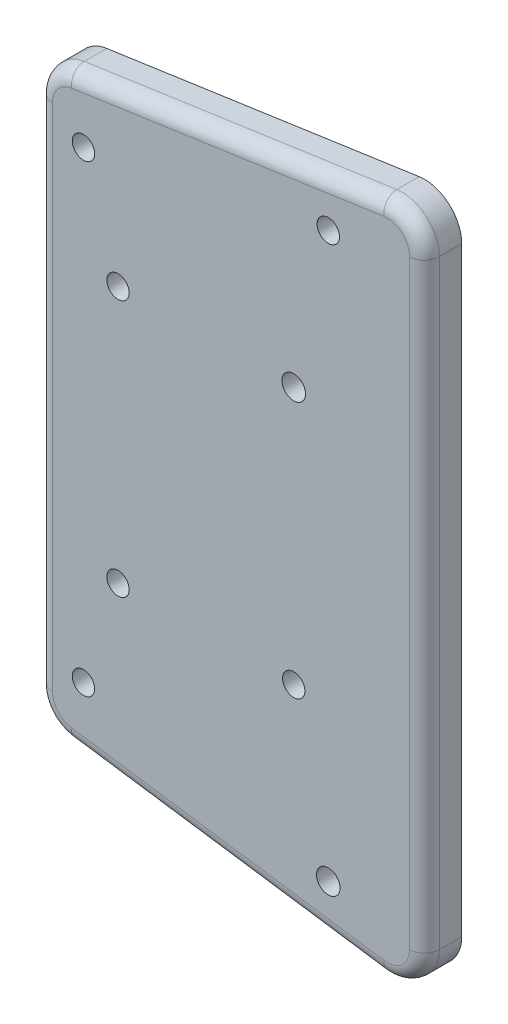
ISO-10303-21;
HEADER;
FILE_DESCRIPTION(('STEP AP214'),'2;1');
FILE_NAME('part.step','',(''),(''),'','','');
FILE_SCHEMA(('AUTOMOTIVE_DESIGN { 1 0 10303 214 1 1 1 1 }'));
ENDSEC;
DATA;
#1=APPLICATION_CONTEXT('core data for automotive mechanical design processes');
#2=APPLICATION_PROTOCOL_DEFINITION('international standard','automotive_design',2000,#1);
#3=PRODUCT_CONTEXT('',#1,'mechanical');
#4=PRODUCT('Part','Part','',(#3));
#5=PRODUCT_RELATED_PRODUCT_CATEGORY('part','',(#4));
#6=PRODUCT_DEFINITION_FORMATION('','',#4);
#7=PRODUCT_DEFINITION_CONTEXT('part definition',#1,'design');
#8=PRODUCT_DEFINITION('design','',#6,#7);
#9=PRODUCT_DEFINITION_SHAPE('','',#8);
#10=(LENGTH_UNIT() NAMED_UNIT(*) SI_UNIT(.MILLI.,.METRE.));
#11=(NAMED_UNIT(*) PLANE_ANGLE_UNIT() SI_UNIT($,.RADIAN.));
#12=(NAMED_UNIT(*) SI_UNIT($,.STERADIAN.) SOLID_ANGLE_UNIT());
#13=UNCERTAINTY_MEASURE_WITH_UNIT(LENGTH_MEASURE(1.E-05),#10,'distance_accuracy_value','');
#14=(GEOMETRIC_REPRESENTATION_CONTEXT(3) GLOBAL_UNCERTAINTY_ASSIGNED_CONTEXT((#13)) GLOBAL_UNIT_ASSIGNED_CONTEXT((#10,
#11,#12)) REPRESENTATION_CONTEXT('',''));
#15=CARTESIAN_POINT('',(0.,0.,0.));
#16=DIRECTION('',(0.,0.,1.));
#17=DIRECTION('',(1.,0.,0.));
#18=AXIS2_PLACEMENT_3D('',#15,#16,#17);
#19=CARTESIAN_POINT('',(20.9522005106054,40.2414995289311,5.));
#20=DIRECTION('',(0.,0.,-1.));
#21=DIRECTION('',(-1.,0.,0.));
#22=AXIS2_PLACEMENT_3D('',#19,#20,#21);
#23=PLANE('',#22);
#24=CARTESIAN_POINT('',(20.9522005106054,40.2414995289311,5.));
#25=DIRECTION('',(0.,0.,-1.));
#26=DIRECTION('',(-1.,0.,0.));
#27=AXIS2_PLACEMENT_3D('',#24,#25,#26);
#28=CIRCLE('',#27,3.);
#29=CARTESIAN_POINT('',(23.9522005106054,40.2414995289311,5.));
#30=VERTEX_POINT('',#29);
#31=CARTESIAN_POINT('',(20.5228210609367,43.210612744725,5.));
#32=VERTEX_POINT('',#31);
#33=EDGE_CURVE('E226',#30,#32,#28,.F.);
#34=ORIENTED_EDGE('',*,*,#33,.T.);
#35=DIRECTION('',(-0.989704405264646,-0.143126483222894,0.));
#36=VECTOR('',#35,1.);
#37=CARTESIAN_POINT('',(20.5228210609367,43.210612744725,5.));
#38=LINE('',#37,#36);
#39=CARTESIAN_POINT('',(-21.3815799602741,37.150591673965,5.));
#40=VERTEX_POINT('',#39);
#41=EDGE_CURVE('E229',#32,#40,#38,.T.);
#42=ORIENTED_EDGE('',*,*,#41,.T.);
#43=CARTESIAN_POINT('',(-20.9522005106054,34.1814784581711,5.));
#44=DIRECTION('',(0.,0.,-1.));
#45=DIRECTION('',(-1.,0.,0.));
#46=AXIS2_PLACEMENT_3D('',#43,#44,#45);
#47=CIRCLE('',#46,3.);
#48=CARTESIAN_POINT('',(-23.9522005106054,34.181478458171,5.));
#49=VERTEX_POINT('',#48);
#50=EDGE_CURVE('E142',#40,#49,#47,.F.);
#51=ORIENTED_EDGE('',*,*,#50,.T.);
#52=DIRECTION('',(0.,-1.,0.));
#53=VECTOR('',#52,1.);
#54=CARTESIAN_POINT('',(-23.9522005106054,40.2414995289311,5.));
#55=LINE('',#54,#53);
#56=CARTESIAN_POINT('',(-23.9522005106054,-34.181478458171,5.));
#57=VERTEX_POINT('',#56);
#58=EDGE_CURVE('E211',#49,#57,#55,.T.);
#59=ORIENTED_EDGE('',*,*,#58,.T.);
#60=CARTESIAN_POINT('',(-20.9522005106054,-34.1814784581711,5.));
#61=DIRECTION('',(0.,0.,-1.));
#62=DIRECTION('',(-1.,0.,0.));
#63=AXIS2_PLACEMENT_3D('',#60,#61,#62);
#64=CIRCLE('',#63,3.);
#65=CARTESIAN_POINT('',(-21.3815799602741,-37.150591673965,5.));
#66=VERTEX_POINT('',#65);
#67=EDGE_CURVE('E214',#57,#66,#64,.F.);
#68=ORIENTED_EDGE('',*,*,#67,.T.);
#69=DIRECTION('',(0.989704405264646,-0.143126483222894,0.));
#70=VECTOR('',#69,1.);
#71=CARTESIAN_POINT('',(9.12216996194288,-41.5619032011782,5.));
#72=LINE('',#71,#70);
#73=CARTESIAN_POINT('',(20.5228210609367,-43.210612744725,5.));
#74=VERTEX_POINT('',#73);
#75=EDGE_CURVE('E217',#66,#74,#72,.T.);
#76=ORIENTED_EDGE('',*,*,#75,.T.);
#77=CARTESIAN_POINT('',(20.9522005106054,-40.2414995289311,5.));
#78=DIRECTION('',(0.,0.,-1.));
#79=DIRECTION('',(-1.,0.,0.));
#80=AXIS2_PLACEMENT_3D('',#77,#78,#79);
#81=CIRCLE('',#80,3.);
#82=CARTESIAN_POINT('',(23.9522005106054,-40.2414995289311,5.));
#83=VERTEX_POINT('',#82);
#84=EDGE_CURVE('E220',#74,#83,#81,.F.);
#85=ORIENTED_EDGE('',*,*,#84,.T.);
#86=DIRECTION('',(0.,1.,0.));
#87=VECTOR('',#86,1.);
#88=CARTESIAN_POINT('',(23.9522005106054,40.2414995289311,5.));
#89=LINE('',#88,#87);
#90=EDGE_CURVE('E223',#83,#30,#89,.T.);
#91=ORIENTED_EDGE('',*,*,#90,.T.);
#92=EDGE_LOOP('',(#34,#42,#51,#59,#68,#76,#85,#91));
#93=FACE_BOUND('',#92,.T.);
#94=CARTESIAN_POINT('',(13.0543618225583,-37.7671205202591,5.));
#95=DIRECTION('',(0.,0.,1.));
#96=DIRECTION('',(1.,0.,0.));
#97=AXIS2_PLACEMENT_3D('',#94,#95,#96);
#98=CIRCLE('',#97,1.57879856612062);
#99=CARTESIAN_POINT('',(14.6331603886789,-37.7671205202591,5.));
#100=VERTEX_POINT('',#99);
#101=EDGE_CURVE('E161',#100,#100,#98,.T.);
#102=ORIENTED_EDGE('',*,*,#101,.F.);
#103=EDGE_LOOP('',(#102));
#104=FACE_BOUND('',#103,.T.);
#105=CARTESIAN_POINT('',(-19.7867074188694,-31.0798565818886,5.));
#106=DIRECTION('',(0.,0.,1.));
#107=DIRECTION('',(1.,0.,0.));
#108=AXIS2_PLACEMENT_3D('',#105,#106,#107);
#109=CIRCLE('',#108,1.5);
#110=CARTESIAN_POINT('',(-18.2867074188694,-31.0798565818886,5.));
#111=VERTEX_POINT('',#110);
#112=EDGE_CURVE('E336',#111,#111,#109,.T.);
#113=ORIENTED_EDGE('',*,*,#112,.F.);
#114=EDGE_LOOP('',(#113));
#115=FACE_BOUND('',#114,.T.);
#116=CARTESIAN_POINT('',(8.41783083386927,-17.2314439170671,5.));
#117=DIRECTION('',(0.,0.,1.));
#118=DIRECTION('',(1.,0.,0.));
#119=AXIS2_PLACEMENT_3D('',#116,#117,#118);
#120=CIRCLE('',#119,1.5);
#121=CARTESIAN_POINT('',(9.91783083386926,-17.2314439170671,5.));
#122=VERTEX_POINT('',#121);
#123=EDGE_CURVE('E328',#122,#122,#120,.T.);
#124=ORIENTED_EDGE('',*,*,#123,.F.);
#125=EDGE_LOOP('',(#124));
#126=FACE_BOUND('',#125,.T.);
#127=CARTESIAN_POINT('',(-15.1501764301804,-17.2314439170671,5.));
#128=DIRECTION('',(0.,0.,1.));
#129=DIRECTION('',(1.,0.,0.));
#130=AXIS2_PLACEMENT_3D('',#127,#128,#129);
#131=CIRCLE('',#130,1.5);
#132=CARTESIAN_POINT('',(-13.6501764301804,-17.2314439170671,5.));
#133=VERTEX_POINT('',#132);
#134=EDGE_CURVE('E320',#133,#133,#131,.T.);
#135=ORIENTED_EDGE('',*,*,#134,.F.);
#136=EDGE_LOOP('',(#135));
#137=FACE_BOUND('',#136,.T.);
#138=CARTESIAN_POINT('',(8.41783083386927,17.3135515468837,5.));
#139=DIRECTION('',(0.,0.,1.));
#140=DIRECTION('',(1.,0.,0.));
#141=AXIS2_PLACEMENT_3D('',#138,#139,#140);
#142=CIRCLE('',#141,1.58210762981665);
#143=CARTESIAN_POINT('',(9.99993846368592,17.3135515468837,5.));
#144=VERTEX_POINT('',#143);
#145=EDGE_CURVE('E312',#144,#144,#142,.T.);
#146=ORIENTED_EDGE('',*,*,#145,.F.);
#147=EDGE_LOOP('',(#146));
#148=FACE_BOUND('',#147,.T.);
#149=CARTESIAN_POINT('',(-15.1501764301804,17.2314439170671,5.));
#150=DIRECTION('',(0.,0.,1.));
#151=DIRECTION('',(1.,0.,0.));
#152=AXIS2_PLACEMENT_3D('',#149,#150,#151);
#153=CIRCLE('',#152,1.5);
#154=CARTESIAN_POINT('',(-13.6501764301804,17.2314439170671,5.));
#155=VERTEX_POINT('',#154);
#156=EDGE_CURVE('E304',#155,#155,#153,.T.);
#157=ORIENTED_EDGE('',*,*,#156,.F.);
#158=EDGE_LOOP('',(#157));
#159=FACE_BOUND('',#158,.T.);
#160=CARTESIAN_POINT('',(-19.7867074188694,31.0798565818886,5.));
#161=DIRECTION('',(0.,0.,1.));
#162=DIRECTION('',(1.,0.,0.));
#163=AXIS2_PLACEMENT_3D('',#160,#161,#162);
#164=CIRCLE('',#163,1.5);
#165=CARTESIAN_POINT('',(-18.2867074188694,31.0798565818886,5.));
#166=VERTEX_POINT('',#165);
#167=EDGE_CURVE('E296',#166,#166,#164,.T.);
#168=ORIENTED_EDGE('',*,*,#167,.F.);
#169=EDGE_LOOP('',(#168));
#170=FACE_BOUND('',#169,.T.);
#171=CARTESIAN_POINT('',(13.0543618225583,37.8459190863797,5.));
#172=DIRECTION('',(0.,0.,1.));
#173=DIRECTION('',(1.,0.,0.));
#174=AXIS2_PLACEMENT_3D('',#171,#172,#173);
#175=CIRCLE('',#174,1.5);
#176=CARTESIAN_POINT('',(14.5543618225583,37.8459190863797,5.));
#177=VERTEX_POINT('',#176);
#178=EDGE_CURVE('E287',#177,#177,#175,.T.);
#179=ORIENTED_EDGE('',*,*,#178,.F.);
#180=EDGE_LOOP('',(#179));
#181=FACE_BOUND('',#180,.T.);
#182=ADVANCED_FACE('F39',(#93,#104,#115,#126,#137,#148,#159,#170,#181),#23,.F.);
#183=CARTESIAN_POINT('',(20.9522005106054,40.2414995289311,0.));
#184=DIRECTION('',(0.,0.,-1.));
#185=DIRECTION('',(-1.,0.,0.));
#186=AXIS2_PLACEMENT_3D('',#183,#184,#185);
#187=PLANE('',#186);
#188=CARTESIAN_POINT('',(-19.7867074188694,31.0798565818886,0.));
#189=DIRECTION('',(0.,0.,1.));
#190=DIRECTION('',(1.,0.,0.));
#191=AXIS2_PLACEMENT_3D('',#188,#189,#190);
#192=CIRCLE('',#191,1.5);
#193=CARTESIAN_POINT('',(-18.2867074188694,31.0798565818886,0.));
#194=VERTEX_POINT('',#193);
#195=EDGE_CURVE('E293',#194,#194,#192,.T.);
#196=ORIENTED_EDGE('',*,*,#195,.T.);
#197=EDGE_LOOP('',(#196));
#198=FACE_BOUND('',#197,.T.);
#199=CARTESIAN_POINT('',(8.41783083386927,17.3135515468837,0.));
#200=DIRECTION('',(0.,0.,1.));
#201=DIRECTION('',(1.,0.,0.));
#202=AXIS2_PLACEMENT_3D('',#199,#200,#201);
#203=CIRCLE('',#202,1.58210762981665);
#204=CARTESIAN_POINT('',(9.99993846368592,17.3135515468837,0.));
#205=VERTEX_POINT('',#204);
#206=EDGE_CURVE('E308',#205,#205,#203,.T.);
#207=ORIENTED_EDGE('',*,*,#206,.T.);
#208=EDGE_LOOP('',(#207));
#209=FACE_BOUND('',#208,.T.);
#210=CARTESIAN_POINT('',(8.41783083386927,-17.2314439170671,0.));
#211=DIRECTION('',(0.,0.,1.));
#212=DIRECTION('',(1.,0.,0.));
#213=AXIS2_PLACEMENT_3D('',#210,#211,#212);
#214=CIRCLE('',#213,1.5);
#215=CARTESIAN_POINT('',(9.91783083386926,-17.2314439170671,0.));
#216=VERTEX_POINT('',#215);
#217=EDGE_CURVE('E324',#216,#216,#214,.T.);
#218=ORIENTED_EDGE('',*,*,#217,.T.);
#219=EDGE_LOOP('',(#218));
#220=FACE_BOUND('',#219,.T.);
#221=CARTESIAN_POINT('',(13.0543618225583,-37.7671205202591,0.));
#222=DIRECTION('',(0.,0.,1.));
#223=DIRECTION('',(1.,0.,0.));
#224=AXIS2_PLACEMENT_3D('',#221,#222,#223);
#225=CIRCLE('',#224,1.57879856612062);
#226=CARTESIAN_POINT('',(14.6331603886789,-37.7671205202591,0.));
#227=VERTEX_POINT('',#226);
#228=EDGE_CURVE('E165',#227,#227,#225,.T.);
#229=ORIENTED_EDGE('',*,*,#228,.T.);
#230=EDGE_LOOP('',(#229));
#231=FACE_BOUND('',#230,.T.);
#232=CARTESIAN_POINT('',(20.9522005106054,40.2414995289311,0.));
#233=DIRECTION('',(0.,0.,1.));
#234=DIRECTION('',(-1.,0.,0.));
#235=AXIS2_PLACEMENT_3D('',#232,#233,#234);
#236=CIRCLE('',#235,5.);
#237=CARTESIAN_POINT('',(25.9522005106054,40.241499528931,0.));
#238=VERTEX_POINT('',#237);
#239=CARTESIAN_POINT('',(20.2365680944909,45.1900215552543,0.));
#240=VERTEX_POINT('',#239);
#241=EDGE_CURVE('E150',#238,#240,#236,.T.);
#242=ORIENTED_EDGE('',*,*,#241,.F.);
#243=DIRECTION('',(0.,1.,0.));
#244=VECTOR('',#243,1.);
#245=CARTESIAN_POINT('',(25.9522005106054,-40.241499528931,0.));
#246=LINE('',#245,#244);
#247=CARTESIAN_POINT('',(25.9522005106054,-40.2414995289311,0.));
#248=VERTEX_POINT('',#247);
#249=EDGE_CURVE('E187',#248,#238,#246,.T.);
#250=ORIENTED_EDGE('',*,*,#249,.F.);
#251=CARTESIAN_POINT('',(20.9522005106054,-40.2414995289311,0.));
#252=DIRECTION('',(0.,0.,1.));
#253=DIRECTION('',(1.,0.,0.));
#254=AXIS2_PLACEMENT_3D('',#251,#252,#253);
#255=CIRCLE('',#254,5.);
#256=CARTESIAN_POINT('',(20.2365680944909,-45.1900215552543,0.));
#257=VERTEX_POINT('',#256);
#258=EDGE_CURVE('E183',#257,#248,#255,.T.);
#259=ORIENTED_EDGE('',*,*,#258,.F.);
#260=DIRECTION('',(0.989704405264646,-0.143126483222894,0.));
#261=VECTOR('',#260,1.);
#262=CARTESIAN_POINT('',(20.2365680944909,-45.1900215552543,0.));
#263=LINE('',#262,#261);
#264=CARTESIAN_POINT('',(-21.6678329267199,-39.1300004844943,0.));
#265=VERTEX_POINT('',#264);
#266=EDGE_CURVE('E179',#265,#257,#263,.T.);
#267=ORIENTED_EDGE('',*,*,#266,.F.);
#268=CARTESIAN_POINT('',(-20.9522005106054,-34.1814784581711,0.));
#269=DIRECTION('',(0.,0.,1.));
#270=DIRECTION('',(-1.,0.,0.));
#271=AXIS2_PLACEMENT_3D('',#268,#269,#270);
#272=CIRCLE('',#271,5.);
#273=CARTESIAN_POINT('',(-25.9522005106054,-34.181478458171,0.));
#274=VERTEX_POINT('',#273);
#275=EDGE_CURVE('E175',#274,#265,#272,.T.);
#276=ORIENTED_EDGE('',*,*,#275,.F.);
#277=DIRECTION('',(0.,-1.,0.));
#278=VECTOR('',#277,1.);
#279=CARTESIAN_POINT('',(-25.9522005106054,-34.181478458171,0.));
#280=LINE('',#279,#278);
#281=CARTESIAN_POINT('',(-25.9522005106054,34.181478458171,0.));
#282=VERTEX_POINT('',#281);
#283=EDGE_CURVE('E171',#282,#274,#280,.T.);
#284=ORIENTED_EDGE('',*,*,#283,.F.);
#285=CARTESIAN_POINT('',(-20.9522005106054,34.1814784581711,0.));
#286=DIRECTION('',(0.,0.,1.));
#287=DIRECTION('',(1.,0.,0.));
#288=AXIS2_PLACEMENT_3D('',#285,#286,#287);
#289=CIRCLE('',#288,5.);
#290=CARTESIAN_POINT('',(-21.6678329267198,39.1300004844943,0.));
#291=VERTEX_POINT('',#290);
#292=EDGE_CURVE('E153',#291,#282,#289,.T.);
#293=ORIENTED_EDGE('',*,*,#292,.F.);
#294=DIRECTION('',(-0.989704405264646,-0.143126483222894,0.));
#295=VECTOR('',#294,1.);
#296=CARTESIAN_POINT('',(20.2365680944909,45.1900215552543,0.));
#297=LINE('',#296,#295);
#298=EDGE_CURVE('E135',#240,#291,#297,.T.);
#299=ORIENTED_EDGE('',*,*,#298,.F.);
#300=EDGE_LOOP('',(#242,#250,#259,#267,#276,#284,#293,#299));
#301=FACE_BOUND('',#300,.T.);
#302=CARTESIAN_POINT('',(-19.7867074188694,-31.0798565818886,0.));
#303=DIRECTION('',(0.,0.,1.));
#304=DIRECTION('',(1.,0.,0.));
#305=AXIS2_PLACEMENT_3D('',#302,#303,#304);
#306=CIRCLE('',#305,1.5);
#307=CARTESIAN_POINT('',(-18.2867074188694,-31.0798565818886,0.));
#308=VERTEX_POINT('',#307);
#309=EDGE_CURVE('E332',#308,#308,#306,.T.);
#310=ORIENTED_EDGE('',*,*,#309,.T.);
#311=EDGE_LOOP('',(#310));
#312=FACE_BOUND('',#311,.T.);
#313=CARTESIAN_POINT('',(-15.1501764301804,-17.2314439170671,0.));
#314=DIRECTION('',(0.,0.,1.));
#315=DIRECTION('',(1.,0.,0.));
#316=AXIS2_PLACEMENT_3D('',#313,#314,#315);
#317=CIRCLE('',#316,1.5);
#318=CARTESIAN_POINT('',(-13.6501764301804,-17.2314439170671,0.));
#319=VERTEX_POINT('',#318);
#320=EDGE_CURVE('E316',#319,#319,#317,.T.);
#321=ORIENTED_EDGE('',*,*,#320,.T.);
#322=EDGE_LOOP('',(#321));
#323=FACE_BOUND('',#322,.T.);
#324=CARTESIAN_POINT('',(-15.1501764301804,17.2314439170671,0.));
#325=DIRECTION('',(0.,0.,1.));
#326=DIRECTION('',(1.,0.,0.));
#327=AXIS2_PLACEMENT_3D('',#324,#325,#326);
#328=CIRCLE('',#327,1.5);
#329=CARTESIAN_POINT('',(-13.6501764301804,17.2314439170671,0.));
#330=VERTEX_POINT('',#329);
#331=EDGE_CURVE('E300',#330,#330,#328,.T.);
#332=ORIENTED_EDGE('',*,*,#331,.T.);
#333=EDGE_LOOP('',(#332));
#334=FACE_BOUND('',#333,.T.);
#335=CARTESIAN_POINT('',(13.0543618225583,37.8459190863797,0.));
#336=DIRECTION('',(0.,0.,1.));
#337=DIRECTION('',(1.,0.,0.));
#338=AXIS2_PLACEMENT_3D('',#335,#336,#337);
#339=CIRCLE('',#338,1.5);
#340=CARTESIAN_POINT('',(14.5543618225583,37.8459190863797,0.));
#341=VERTEX_POINT('',#340);
#342=EDGE_CURVE('E280',#341,#341,#339,.T.);
#343=ORIENTED_EDGE('',*,*,#342,.T.);
#344=EDGE_LOOP('',(#343));
#345=FACE_BOUND('',#344,.T.);
#346=ADVANCED_FACE('F147',(#198,#209,#220,#231,#301,#312,#323,#334,#345),#187,.T.);
#347=CARTESIAN_POINT('',(20.9522005106054,40.2414995289311,5.));
#348=DIRECTION('',(0.,0.,-1.));
#349=DIRECTION('',(-1.,0.,0.));
#350=AXIS2_PLACEMENT_3D('',#347,#348,#349);
#351=CYLINDRICAL_SURFACE('',#350,5.);
#352=DIRECTION('',(0.,0.,-1.));
#353=VECTOR('',#352,1.);
#354=CARTESIAN_POINT('',(20.2365680944909,45.1900215552543,5.));
#355=LINE('',#354,#353);
#356=CARTESIAN_POINT('',(20.2365680944909,45.1900215552543,3.));
#357=VERTEX_POINT('',#356);
#358=EDGE_CURVE('E131',#357,#240,#355,.T.);
#359=ORIENTED_EDGE('',*,*,#358,.F.);
#360=CARTESIAN_POINT('',(20.9522005106054,40.2414995289311,3.));
#361=DIRECTION('',(0.,0.,-1.));
#362=DIRECTION('',(-1.,0.,0.));
#363=AXIS2_PLACEMENT_3D('',#360,#361,#362);
#364=CIRCLE('',#363,5.);
#365=CARTESIAN_POINT('',(25.9522005106054,40.241499528931,3.));
#366=VERTEX_POINT('',#365);
#367=EDGE_CURVE('E235',#357,#366,#364,.T.);
#368=ORIENTED_EDGE('',*,*,#367,.T.);
#369=DIRECTION('',(0.,0.,-1.));
#370=VECTOR('',#369,1.);
#371=CARTESIAN_POINT('',(25.9522005106054,40.241499528931,5.));
#372=LINE('',#371,#370);
#373=EDGE_CURVE('E158',#366,#238,#372,.T.);
#374=ORIENTED_EDGE('',*,*,#373,.T.);
#375=ORIENTED_EDGE('',*,*,#241,.T.);
#376=EDGE_LOOP('',(#359,#368,#374,#375));
#377=FACE_BOUND('',#376,.T.);
#378=ADVANCED_FACE('F156',(#377),#351,.T.);
#379=CARTESIAN_POINT('',(20.2365680944909,45.1900215552543,5.));
#380=DIRECTION('',(0.143126483222894,-0.989704405264646,0.));
#381=DIRECTION('',(0.989704405264646,0.143126483222894,0.));
#382=AXIS2_PLACEMENT_3D('',#379,#380,#381);
#383=PLANE('',#382);
#384=DIRECTION('',(0.,0.,-1.));
#385=VECTOR('',#384,1.);
#386=CARTESIAN_POINT('',(-21.6678329267198,39.1300004844943,5.));
#387=LINE('',#386,#385);
#388=CARTESIAN_POINT('',(-21.6678329267198,39.1300004844943,3.));
#389=VERTEX_POINT('',#388);
#390=EDGE_CURVE('E143',#389,#291,#387,.T.);
#391=ORIENTED_EDGE('',*,*,#390,.F.);
#392=DIRECTION('',(-0.989704405264646,-0.143126483222894,0.));
#393=VECTOR('',#392,1.);
#394=CARTESIAN_POINT('',(20.2365680944909,45.1900215552543,3.));
#395=LINE('',#394,#393);
#396=EDGE_CURVE('E138',#389,#357,#395,.F.);
#397=ORIENTED_EDGE('',*,*,#396,.T.);
#398=ORIENTED_EDGE('',*,*,#358,.T.);
#399=ORIENTED_EDGE('',*,*,#298,.T.);
#400=EDGE_LOOP('',(#391,#397,#398,#399));
#401=FACE_BOUND('',#400,.T.);
#402=ADVANCED_FACE('F134',(#401),#383,.F.);
#403=CARTESIAN_POINT('',(-20.9522005106054,34.1814784581711,5.));
#404=DIRECTION('',(0.,0.,-1.));
#405=DIRECTION('',(-1.,0.,0.));
#406=AXIS2_PLACEMENT_3D('',#403,#404,#405);
#407=CYLINDRICAL_SURFACE('',#406,5.);
#408=DIRECTION('',(0.,0.,-1.));
#409=VECTOR('',#408,1.);
#410=CARTESIAN_POINT('',(-25.9522005106054,34.181478458171,5.));
#411=LINE('',#410,#409);
#412=CARTESIAN_POINT('',(-25.9522005106054,34.181478458171,3.));
#413=VERTEX_POINT('',#412);
#414=EDGE_CURVE('E204',#413,#282,#411,.T.);
#415=ORIENTED_EDGE('',*,*,#414,.F.);
#416=CARTESIAN_POINT('',(-20.9522005106054,34.1814784581711,3.));
#417=DIRECTION('',(0.,0.,-1.));
#418=DIRECTION('',(-1.,0.,0.));
#419=AXIS2_PLACEMENT_3D('',#416,#417,#418);
#420=CIRCLE('',#419,5.);
#421=EDGE_CURVE('E11',#413,#389,#420,.T.);
#422=ORIENTED_EDGE('',*,*,#421,.T.);
#423=ORIENTED_EDGE('',*,*,#390,.T.);
#424=ORIENTED_EDGE('',*,*,#292,.T.);
#425=EDGE_LOOP('',(#415,#422,#423,#424));
#426=FACE_BOUND('',#425,.T.);
#427=ADVANCED_FACE('F388',(#426),#407,.T.);
#428=CARTESIAN_POINT('',(-25.9522005106054,-34.181478458171,5.));
#429=DIRECTION('',(1.,0.,0.));
#430=DIRECTION('',(0.,1.,0.));
#431=AXIS2_PLACEMENT_3D('',#428,#429,#430);
#432=PLANE('',#431);
#433=DIRECTION('',(0.,0.,-1.));
#434=VECTOR('',#433,1.);
#435=CARTESIAN_POINT('',(-25.9522005106054,-34.181478458171,5.));
#436=LINE('',#435,#434);
#437=CARTESIAN_POINT('',(-25.9522005106054,-34.181478458171,3.));
#438=VERTEX_POINT('',#437);
#439=EDGE_CURVE('E201',#438,#274,#436,.T.);
#440=ORIENTED_EDGE('',*,*,#439,.F.);
#441=DIRECTION('',(0.,-1.,0.));
#442=VECTOR('',#441,1.);
#443=CARTESIAN_POINT('',(-25.9522005106054,-34.181478458171,3.));
#444=LINE('',#443,#442);
#445=EDGE_CURVE('E49',#438,#413,#444,.F.);
#446=ORIENTED_EDGE('',*,*,#445,.T.);
#447=ORIENTED_EDGE('',*,*,#414,.T.);
#448=ORIENTED_EDGE('',*,*,#283,.T.);
#449=EDGE_LOOP('',(#440,#446,#447,#448));
#450=FACE_BOUND('',#449,.T.);
#451=ADVANCED_FACE('F385',(#450),#432,.F.);
#452=CARTESIAN_POINT('',(-20.9522005106054,-34.1814784581711,5.));
#453=DIRECTION('',(0.,0.,-1.));
#454=DIRECTION('',(-1.,0.,0.));
#455=AXIS2_PLACEMENT_3D('',#452,#453,#454);
#456=CYLINDRICAL_SURFACE('',#455,5.);
#457=DIRECTION('',(0.,0.,-1.));
#458=VECTOR('',#457,1.);
#459=CARTESIAN_POINT('',(-21.6678329267199,-39.1300004844943,5.));
#460=LINE('',#459,#458);
#461=CARTESIAN_POINT('',(-21.6678329267199,-39.1300004844943,3.));
#462=VERTEX_POINT('',#461);
#463=EDGE_CURVE('E198',#462,#265,#460,.T.);
#464=ORIENTED_EDGE('',*,*,#463,.F.);
#465=CARTESIAN_POINT('',(-20.9522005106054,-34.1814784581711,3.));
#466=DIRECTION('',(0.,0.,-1.));
#467=DIRECTION('',(-1.,0.,0.));
#468=AXIS2_PLACEMENT_3D('',#465,#466,#467);
#469=CIRCLE('',#468,5.);
#470=EDGE_CURVE('E64',#462,#438,#469,.T.);
#471=ORIENTED_EDGE('',*,*,#470,.T.);
#472=ORIENTED_EDGE('',*,*,#439,.T.);
#473=ORIENTED_EDGE('',*,*,#275,.T.);
#474=EDGE_LOOP('',(#464,#471,#472,#473));
#475=FACE_BOUND('',#474,.T.);
#476=ADVANCED_FACE('F381',(#475),#456,.T.);
#477=CARTESIAN_POINT('',(20.2365680944909,-45.1900215552543,5.));
#478=DIRECTION('',(0.143126483222894,0.989704405264646,0.));
#479=DIRECTION('',(-0.989704405264646,0.143126483222894,0.));
#480=AXIS2_PLACEMENT_3D('',#477,#478,#479);
#481=PLANE('',#480);
#482=DIRECTION('',(0.,0.,-1.));
#483=VECTOR('',#482,1.);
#484=CARTESIAN_POINT('',(20.2365680944909,-45.1900215552543,5.));
#485=LINE('',#484,#483);
#486=CARTESIAN_POINT('',(20.2365680944909,-45.1900215552543,3.));
#487=VERTEX_POINT('',#486);
#488=EDGE_CURVE('E195',#487,#257,#485,.T.);
#489=ORIENTED_EDGE('',*,*,#488,.F.);
#490=DIRECTION('',(0.989704405264646,-0.143126483222894,0.));
#491=VECTOR('',#490,1.);
#492=CARTESIAN_POINT('',(20.2365680944909,-45.1900215552543,3.));
#493=LINE('',#492,#491);
#494=EDGE_CURVE('E244',#487,#462,#493,.F.);
#495=ORIENTED_EDGE('',*,*,#494,.T.);
#496=ORIENTED_EDGE('',*,*,#463,.T.);
#497=ORIENTED_EDGE('',*,*,#266,.T.);
#498=EDGE_LOOP('',(#489,#495,#496,#497));
#499=FACE_BOUND('',#498,.T.);
#500=ADVANCED_FACE('F377',(#499),#481,.F.);
#501=CARTESIAN_POINT('',(20.9522005106054,-40.2414995289311,5.));
#502=DIRECTION('',(0.,0.,-1.));
#503=DIRECTION('',(-1.,0.,0.));
#504=AXIS2_PLACEMENT_3D('',#501,#502,#503);
#505=CYLINDRICAL_SURFACE('',#504,5.);
#506=DIRECTION('',(0.,0.,-1.));
#507=VECTOR('',#506,1.);
#508=CARTESIAN_POINT('',(25.9522005106054,-40.2414995289311,5.));
#509=LINE('',#508,#507);
#510=CARTESIAN_POINT('',(25.9522005106054,-40.2414995289311,3.));
#511=VERTEX_POINT('',#510);
#512=EDGE_CURVE('E192',#511,#248,#509,.T.);
#513=ORIENTED_EDGE('',*,*,#512,.F.);
#514=CARTESIAN_POINT('',(20.9522005106054,-40.2414995289311,3.));
#515=DIRECTION('',(0.,0.,-1.));
#516=DIRECTION('',(-1.,0.,0.));
#517=AXIS2_PLACEMENT_3D('',#514,#515,#516);
#518=CIRCLE('',#517,5.);
#519=EDGE_CURVE('E241',#511,#487,#518,.T.);
#520=ORIENTED_EDGE('',*,*,#519,.T.);
#521=ORIENTED_EDGE('',*,*,#488,.T.);
#522=ORIENTED_EDGE('',*,*,#258,.T.);
#523=EDGE_LOOP('',(#513,#520,#521,#522));
#524=FACE_BOUND('',#523,.T.);
#525=ADVANCED_FACE('F373',(#524),#505,.T.);
#526=CARTESIAN_POINT('',(25.9522005106054,-40.241499528931,5.));
#527=DIRECTION('',(-1.,0.,0.));
#528=DIRECTION('',(0.,0.,1.));
#529=AXIS2_PLACEMENT_3D('',#526,#527,#528);
#530=PLANE('',#529);
#531=ORIENTED_EDGE('',*,*,#373,.F.);
#532=DIRECTION('',(0.,1.,0.));
#533=VECTOR('',#532,1.);
#534=CARTESIAN_POINT('',(25.9522005106054,-40.241499528931,3.));
#535=LINE('',#534,#533);
#536=EDGE_CURVE('E238',#366,#511,#535,.F.);
#537=ORIENTED_EDGE('',*,*,#536,.T.);
#538=ORIENTED_EDGE('',*,*,#512,.T.);
#539=ORIENTED_EDGE('',*,*,#249,.T.);
#540=EDGE_LOOP('',(#531,#537,#538,#539));
#541=FACE_BOUND('',#540,.T.);
#542=ADVANCED_FACE('F358',(#541),#530,.F.);
#543=CARTESIAN_POINT('',(13.0543618225583,-37.7671205202591,5.));
#544=DIRECTION('',(0.,0.,-1.));
#545=DIRECTION('',(-1.,0.,0.));
#546=AXIS2_PLACEMENT_3D('',#543,#544,#545);
#547=CYLINDRICAL_SURFACE('',#546,1.57879856612062);
#548=ORIENTED_EDGE('',*,*,#101,.T.);
#549=EDGE_LOOP('',(#548));
#550=FACE_BOUND('',#549,.T.);
#551=ORIENTED_EDGE('',*,*,#228,.F.);
#552=EDGE_LOOP('',(#551));
#553=FACE_BOUND('',#552,.T.);
#554=ADVANCED_FACE('F348',(#550,#553),#547,.F.);
#555=CARTESIAN_POINT('',(-19.7867074188694,-31.0798565818886,5.));
#556=DIRECTION('',(0.,0.,-1.));
#557=DIRECTION('',(-1.,0.,0.));
#558=AXIS2_PLACEMENT_3D('',#555,#556,#557);
#559=CYLINDRICAL_SURFACE('',#558,1.5);
#560=ORIENTED_EDGE('',*,*,#112,.T.);
#561=EDGE_LOOP('',(#560));
#562=FACE_BOUND('',#561,.T.);
#563=ORIENTED_EDGE('',*,*,#309,.F.);
#564=EDGE_LOOP('',(#563));
#565=FACE_BOUND('',#564,.T.);
#566=ADVANCED_FACE('F345',(#562,#565),#559,.F.);
#567=CARTESIAN_POINT('',(8.41783083386927,-17.2314439170671,5.));
#568=DIRECTION('',(0.,0.,-1.));
#569=DIRECTION('',(-1.,0.,0.));
#570=AXIS2_PLACEMENT_3D('',#567,#568,#569);
#571=CYLINDRICAL_SURFACE('',#570,1.5);
#572=ORIENTED_EDGE('',*,*,#123,.T.);
#573=EDGE_LOOP('',(#572));
#574=FACE_BOUND('',#573,.T.);
#575=ORIENTED_EDGE('',*,*,#217,.F.);
#576=EDGE_LOOP('',(#575));
#577=FACE_BOUND('',#576,.T.);
#578=ADVANCED_FACE('F347',(#574,#577),#571,.F.);
#579=CARTESIAN_POINT('',(-15.1501764301804,-17.2314439170671,5.));
#580=DIRECTION('',(0.,0.,-1.));
#581=DIRECTION('',(-1.,0.,0.));
#582=AXIS2_PLACEMENT_3D('',#579,#580,#581);
#583=CYLINDRICAL_SURFACE('',#582,1.5);
#584=ORIENTED_EDGE('',*,*,#134,.T.);
#585=EDGE_LOOP('',(#584));
#586=FACE_BOUND('',#585,.T.);
#587=ORIENTED_EDGE('',*,*,#320,.F.);
#588=EDGE_LOOP('',(#587));
#589=FACE_BOUND('',#588,.T.);
#590=ADVANCED_FACE('F355',(#586,#589),#583,.F.);
#591=CARTESIAN_POINT('',(8.41783083386927,17.3135515468837,5.));
#592=DIRECTION('',(0.,0.,-1.));
#593=DIRECTION('',(-1.,0.,0.));
#594=AXIS2_PLACEMENT_3D('',#591,#592,#593);
#595=CYLINDRICAL_SURFACE('',#594,1.58210762981665);
#596=ORIENTED_EDGE('',*,*,#145,.T.);
#597=EDGE_LOOP('',(#596));
#598=FACE_BOUND('',#597,.T.);
#599=ORIENTED_EDGE('',*,*,#206,.F.);
#600=EDGE_LOOP('',(#599));
#601=FACE_BOUND('',#600,.T.);
#602=ADVANCED_FACE('F462',(#598,#601),#595,.F.);
#603=CARTESIAN_POINT('',(-15.1501764301804,17.2314439170671,5.));
#604=DIRECTION('',(0.,0.,-1.));
#605=DIRECTION('',(-1.,0.,0.));
#606=AXIS2_PLACEMENT_3D('',#603,#604,#605);
#607=CYLINDRICAL_SURFACE('',#606,1.5);
#608=ORIENTED_EDGE('',*,*,#156,.T.);
#609=EDGE_LOOP('',(#608));
#610=FACE_BOUND('',#609,.T.);
#611=ORIENTED_EDGE('',*,*,#331,.F.);
#612=EDGE_LOOP('',(#611));
#613=FACE_BOUND('',#612,.T.);
#614=ADVANCED_FACE('F455',(#610,#613),#607,.F.);
#615=CARTESIAN_POINT('',(-19.7867074188694,31.0798565818886,5.));
#616=DIRECTION('',(0.,0.,-1.));
#617=DIRECTION('',(-1.,0.,0.));
#618=AXIS2_PLACEMENT_3D('',#615,#616,#617);
#619=CYLINDRICAL_SURFACE('',#618,1.5);
#620=ORIENTED_EDGE('',*,*,#167,.T.);
#621=EDGE_LOOP('',(#620));
#622=FACE_BOUND('',#621,.T.);
#623=ORIENTED_EDGE('',*,*,#195,.F.);
#624=EDGE_LOOP('',(#623));
#625=FACE_BOUND('',#624,.T.);
#626=ADVANCED_FACE('F428',(#622,#625),#619,.F.);
#627=CARTESIAN_POINT('',(13.0543618225583,37.8459190863797,5.));
#628=DIRECTION('',(0.,0.,-1.));
#629=DIRECTION('',(-1.,0.,0.));
#630=AXIS2_PLACEMENT_3D('',#627,#628,#629);
#631=CYLINDRICAL_SURFACE('',#630,1.5);
#632=ORIENTED_EDGE('',*,*,#178,.T.);
#633=EDGE_LOOP('',(#632));
#634=FACE_BOUND('',#633,.T.);
#635=ORIENTED_EDGE('',*,*,#342,.F.);
#636=EDGE_LOOP('',(#635));
#637=FACE_BOUND('',#636,.T.);
#638=ADVANCED_FACE('F423',(#634,#637),#631,.F.);
#639=CARTESIAN_POINT('',(9.12216996194289,-41.5619032011781,3.));
#640=DIRECTION('',(0.989704405264646,-0.143126483222894,0.));
#641=DIRECTION('',(0.143126483222894,0.989704405264646,0.));
#642=AXIS2_PLACEMENT_3D('',#639,#640,#641);
#643=CYLINDRICAL_SURFACE('',#642,2.);
#644=CARTESIAN_POINT('',(-21.3815799602741,-37.150591673965,3.));
#645=DIRECTION('',(-0.989704405264646,0.143126483222894,0.));
#646=DIRECTION('',(-0.143126483222894,-0.989704405264646,0.));
#647=AXIS2_PLACEMENT_3D('',#644,#645,#646);
#648=CIRCLE('',#647,2.);
#649=EDGE_CURVE('E272',#462,#66,#648,.T.);
#650=ORIENTED_EDGE('',*,*,#649,.F.);
#651=ORIENTED_EDGE('',*,*,#494,.F.);
#652=CARTESIAN_POINT('',(20.5228210609367,-43.210612744725,3.));
#653=DIRECTION('',(0.989704405264645,-0.143126483222903,0.));
#654=DIRECTION('',(0.143126483222903,0.989704405264645,0.));
#655=AXIS2_PLACEMENT_3D('',#652,#653,#654);
#656=CIRCLE('',#655,2.);
#657=EDGE_CURVE('E43',#74,#487,#656,.T.);
#658=ORIENTED_EDGE('',*,*,#657,.F.);
#659=ORIENTED_EDGE('',*,*,#75,.F.);
#660=EDGE_LOOP('',(#650,#651,#658,#659));
#661=FACE_BOUND('',#660,.T.);
#662=ADVANCED_FACE('F41',(#661),#643,.T.);
#663=CARTESIAN_POINT('',(20.9522005106054,-40.2414995289311,3.));
#664=DIRECTION('',(0.,0.,-1.));
#665=DIRECTION('',(-1.,0.,0.));
#666=AXIS2_PLACEMENT_3D('',#663,#664,#665);
#667=TOROIDAL_SURFACE('',#666,3.,2.);
#668=ORIENTED_EDGE('',*,*,#657,.T.);
#669=ORIENTED_EDGE('',*,*,#519,.F.);
#670=CARTESIAN_POINT('',(23.9522005106054,-40.2414995289311,3.));
#671=DIRECTION('',(0.,1.,0.));
#672=DIRECTION('',(0.,0.,1.));
#673=AXIS2_PLACEMENT_3D('',#670,#671,#672);
#674=CIRCLE('',#673,2.);
#675=EDGE_CURVE('E269',#83,#511,#674,.T.);
#676=ORIENTED_EDGE('',*,*,#675,.F.);
#677=ORIENTED_EDGE('',*,*,#84,.F.);
#678=EDGE_LOOP('',(#668,#669,#676,#677));
#679=FACE_BOUND('',#678,.T.);
#680=ADVANCED_FACE('F418',(#679),#667,.T.);
#681=CARTESIAN_POINT('',(-20.9522005106054,-34.1814784581711,3.));
#682=DIRECTION('',(0.,0.,-1.));
#683=DIRECTION('',(-1.,0.,0.));
#684=AXIS2_PLACEMENT_3D('',#681,#682,#683);
#685=TOROIDAL_SURFACE('',#684,3.,2.);
#686=ORIENTED_EDGE('',*,*,#649,.T.);
#687=ORIENTED_EDGE('',*,*,#67,.F.);
#688=CARTESIAN_POINT('',(-23.9522005106054,-34.181478458171,3.));
#689=DIRECTION('',(0.,1.,0.));
#690=DIRECTION('',(-1.,0.,0.));
#691=AXIS2_PLACEMENT_3D('',#688,#689,#690);
#692=CIRCLE('',#691,2.);
#693=EDGE_CURVE('E265',#438,#57,#692,.T.);
#694=ORIENTED_EDGE('',*,*,#693,.F.);
#695=ORIENTED_EDGE('',*,*,#470,.F.);
#696=EDGE_LOOP('',(#686,#687,#694,#695));
#697=FACE_BOUND('',#696,.T.);
#698=ADVANCED_FACE('F415',(#697),#685,.T.);
#699=CARTESIAN_POINT('',(23.9522005106054,40.2414995289311,3.));
#700=DIRECTION('',(0.,1.,0.));
#701=DIRECTION('',(0.,0.,1.));
#702=AXIS2_PLACEMENT_3D('',#699,#700,#701);
#703=CYLINDRICAL_SURFACE('',#702,2.);
#704=ORIENTED_EDGE('',*,*,#675,.T.);
#705=ORIENTED_EDGE('',*,*,#536,.F.);
#706=CARTESIAN_POINT('',(23.9522005106054,40.2414995289311,3.));
#707=DIRECTION('',(0.,1.,0.));
#708=DIRECTION('',(-1.,0.,0.));
#709=AXIS2_PLACEMENT_3D('',#706,#707,#708);
#710=CIRCLE('',#709,2.);
#711=EDGE_CURVE('E261',#30,#366,#710,.T.);
#712=ORIENTED_EDGE('',*,*,#711,.F.);
#713=ORIENTED_EDGE('',*,*,#90,.F.);
#714=EDGE_LOOP('',(#704,#705,#712,#713));
#715=FACE_BOUND('',#714,.T.);
#716=ADVANCED_FACE('F411',(#715),#703,.T.);
#717=CARTESIAN_POINT('',(-23.9522005106054,40.2414995289311,3.));
#718=DIRECTION('',(0.,-1.,0.));
#719=DIRECTION('',(1.,0.,0.));
#720=AXIS2_PLACEMENT_3D('',#717,#718,#719);
#721=CYLINDRICAL_SURFACE('',#720,2.);
#722=ORIENTED_EDGE('',*,*,#693,.T.);
#723=ORIENTED_EDGE('',*,*,#58,.F.);
#724=CARTESIAN_POINT('',(-23.9522005106054,34.181478458171,3.));
#725=DIRECTION('',(0.,1.,0.));
#726=DIRECTION('',(0.,0.,1.));
#727=AXIS2_PLACEMENT_3D('',#724,#725,#726);
#728=CIRCLE('',#727,2.);
#729=EDGE_CURVE('E257',#413,#49,#728,.T.);
#730=ORIENTED_EDGE('',*,*,#729,.F.);
#731=ORIENTED_EDGE('',*,*,#445,.F.);
#732=EDGE_LOOP('',(#722,#723,#730,#731));
#733=FACE_BOUND('',#732,.T.);
#734=ADVANCED_FACE('F407',(#733),#721,.T.);
#735=CARTESIAN_POINT('',(20.9522005106054,40.2414995289311,3.));
#736=DIRECTION('',(0.,0.,-1.));
#737=DIRECTION('',(-1.,0.,0.));
#738=AXIS2_PLACEMENT_3D('',#735,#736,#737);
#739=TOROIDAL_SURFACE('',#738,3.,2.);
#740=ORIENTED_EDGE('',*,*,#711,.T.);
#741=ORIENTED_EDGE('',*,*,#367,.F.);
#742=CARTESIAN_POINT('',(20.5228210609367,43.210612744725,3.));
#743=DIRECTION('',(-0.989704405264646,-0.143126483222894,0.));
#744=DIRECTION('',(0.143126483222894,-0.989704405264646,0.));
#745=AXIS2_PLACEMENT_3D('',#742,#743,#744);
#746=CIRCLE('',#745,2.);
#747=EDGE_CURVE('E254',#32,#357,#746,.T.);
#748=ORIENTED_EDGE('',*,*,#747,.F.);
#749=ORIENTED_EDGE('',*,*,#33,.F.);
#750=EDGE_LOOP('',(#740,#741,#748,#749));
#751=FACE_BOUND('',#750,.T.);
#752=ADVANCED_FACE('F403',(#751),#739,.T.);
#753=CARTESIAN_POINT('',(-20.9522005106054,34.1814784581711,3.));
#754=DIRECTION('',(0.,0.,-1.));
#755=DIRECTION('',(-1.,0.,0.));
#756=AXIS2_PLACEMENT_3D('',#753,#754,#755);
#757=TOROIDAL_SURFACE('',#756,3.,2.);
#758=ORIENTED_EDGE('',*,*,#729,.T.);
#759=ORIENTED_EDGE('',*,*,#50,.F.);
#760=CARTESIAN_POINT('',(-21.3815799602741,37.150591673965,3.));
#761=DIRECTION('',(0.989704405264647,0.143126483222889,0.));
#762=DIRECTION('',(-0.143126483222889,0.989704405264647,0.));
#763=AXIS2_PLACEMENT_3D('',#760,#761,#762);
#764=CIRCLE('',#763,2.);
#765=EDGE_CURVE('E251',#389,#40,#764,.T.);
#766=ORIENTED_EDGE('',*,*,#765,.F.);
#767=ORIENTED_EDGE('',*,*,#421,.F.);
#768=EDGE_LOOP('',(#758,#759,#766,#767));
#769=FACE_BOUND('',#768,.T.);
#770=ADVANCED_FACE('F399',(#769),#757,.T.);
#771=CARTESIAN_POINT('',(20.5228210609367,43.210612744725,3.));
#772=DIRECTION('',(-0.989704405264646,-0.143126483222894,0.));
#773=DIRECTION('',(0.143126483222894,-0.989704405264646,0.));
#774=AXIS2_PLACEMENT_3D('',#771,#772,#773);
#775=CYLINDRICAL_SURFACE('',#774,2.);
#776=ORIENTED_EDGE('',*,*,#747,.T.);
#777=ORIENTED_EDGE('',*,*,#396,.F.);
#778=ORIENTED_EDGE('',*,*,#765,.T.);
#779=ORIENTED_EDGE('',*,*,#41,.F.);
#780=EDGE_LOOP('',(#776,#777,#778,#779));
#781=FACE_BOUND('',#780,.T.);
#782=ADVANCED_FACE('F396',(#781),#775,.T.);
#783=CLOSED_SHELL('',(#182,#346,#378,#402,#427,#451,#476,#500,#525,#542,#554,#566,#578,#590,
#602,#614,#626,#638,#662,#680,#698,#716,#734,#752,#770,#782));
#784=MANIFOLD_SOLID_BREP('B2',#783);
#785=ADVANCED_BREP_SHAPE_REPRESENTATION('',(#18,#784),#14);
#786=SHAPE_DEFINITION_REPRESENTATION(#9,#785);
ENDSEC;
END-ISO-10303-21;
